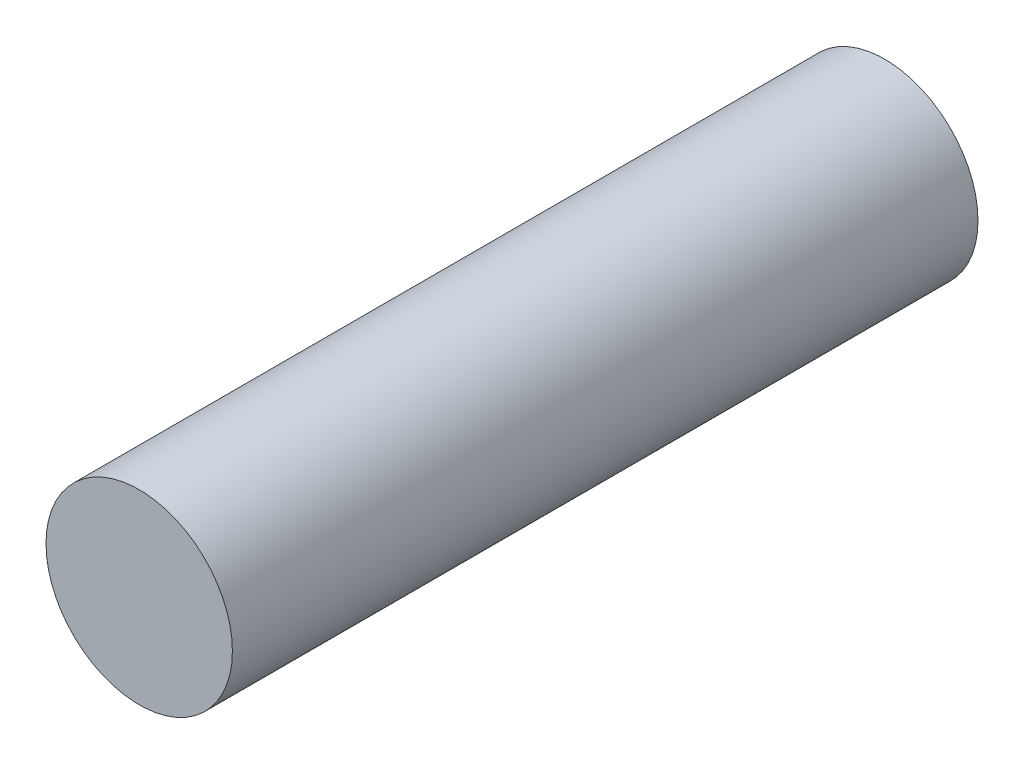
ISO-10303-21;
HEADER;
FILE_DESCRIPTION(('STEP AP214'),'2;1');
FILE_NAME('part.step','',(''),(''),'','','');
FILE_SCHEMA(('AUTOMOTIVE_DESIGN { 1 0 10303 214 1 1 1 1 }'));
ENDSEC;
DATA;
#1=APPLICATION_CONTEXT('core data for automotive mechanical design processes');
#2=APPLICATION_PROTOCOL_DEFINITION('international standard','automotive_design',2000,#1);
#3=PRODUCT_CONTEXT('',#1,'mechanical');
#4=PRODUCT('Part','Part','',(#3));
#5=PRODUCT_RELATED_PRODUCT_CATEGORY('part','',(#4));
#6=PRODUCT_DEFINITION_FORMATION('','',#4);
#7=PRODUCT_DEFINITION_CONTEXT('part definition',#1,'design');
#8=PRODUCT_DEFINITION('design','',#6,#7);
#9=PRODUCT_DEFINITION_SHAPE('','',#8);
#10=(LENGTH_UNIT() NAMED_UNIT(*) SI_UNIT(.MILLI.,.METRE.));
#11=(NAMED_UNIT(*) PLANE_ANGLE_UNIT() SI_UNIT($,.RADIAN.));
#12=(NAMED_UNIT(*) SI_UNIT($,.STERADIAN.) SOLID_ANGLE_UNIT());
#13=UNCERTAINTY_MEASURE_WITH_UNIT(LENGTH_MEASURE(1.E-05),#10,'distance_accuracy_value','');
#14=(GEOMETRIC_REPRESENTATION_CONTEXT(3) GLOBAL_UNCERTAINTY_ASSIGNED_CONTEXT((#13)) GLOBAL_UNIT_ASSIGNED_CONTEXT((#10,
#11,#12)) REPRESENTATION_CONTEXT('',''));
#15=CARTESIAN_POINT('',(0.,0.,0.));
#16=DIRECTION('',(0.,0.,1.));
#17=DIRECTION('',(1.,0.,0.));
#18=AXIS2_PLACEMENT_3D('',#15,#16,#17);
#19=CARTESIAN_POINT('',(0.,0.,10.));
#20=DIRECTION('',(0.,0.,-1.));
#21=DIRECTION('',(-1.,0.,0.));
#22=AXIS2_PLACEMENT_3D('',#19,#20,#21);
#23=CYLINDRICAL_SURFACE('',#22,1.25);
#24=CARTESIAN_POINT('',(0.,0.,10.));
#25=DIRECTION('',(0.,0.,1.));
#26=DIRECTION('',(1.,0.,0.));
#27=AXIS2_PLACEMENT_3D('',#24,#25,#26);
#28=CIRCLE('',#27,1.25);
#29=CARTESIAN_POINT('',(1.25,0.,10.));
#30=VERTEX_POINT('',#29);
#31=EDGE_CURVE('E10',#30,#30,#28,.T.);
#32=ORIENTED_EDGE('',*,*,#31,.F.);
#33=EDGE_LOOP('',(#32));
#34=FACE_BOUND('',#33,.T.);
#35=CARTESIAN_POINT('',(0.,0.,0.));
#36=DIRECTION('',(0.,0.,1.));
#37=DIRECTION('',(1.,0.,0.));
#38=AXIS2_PLACEMENT_3D('',#35,#36,#37);
#39=CIRCLE('',#38,1.25);
#40=CARTESIAN_POINT('',(1.25,0.,0.));
#41=VERTEX_POINT('',#40);
#42=EDGE_CURVE('E46',#41,#41,#39,.T.);
#43=ORIENTED_EDGE('',*,*,#42,.T.);
#44=EDGE_LOOP('',(#43));
#45=FACE_BOUND('',#44,.T.);
#46=ADVANCED_FACE('F43',(#34,#45),#23,.T.);
#47=CARTESIAN_POINT('',(0.,0.,10.));
#48=DIRECTION('',(0.,0.,1.));
#49=DIRECTION('',(1.,0.,0.));
#50=AXIS2_PLACEMENT_3D('',#47,#48,#49);
#51=PLANE('',#50);
#52=ORIENTED_EDGE('',*,*,#31,.T.);
#53=EDGE_LOOP('',(#52));
#54=FACE_BOUND('',#53,.T.);
#55=ADVANCED_FACE('F60',(#54),#51,.T.);
#56=CARTESIAN_POINT('',(0.,0.,0.));
#57=DIRECTION('',(0.,0.,1.));
#58=DIRECTION('',(1.,0.,0.));
#59=AXIS2_PLACEMENT_3D('',#56,#57,#58);
#60=PLANE('',#59);
#61=ORIENTED_EDGE('',*,*,#42,.F.);
#62=EDGE_LOOP('',(#61));
#63=FACE_BOUND('',#62,.T.);
#64=ADVANCED_FACE('F58',(#63),#60,.F.);
#65=CLOSED_SHELL('',(#46,#55,#64));
#66=MANIFOLD_SOLID_BREP('B2',#65);
#67=ADVANCED_BREP_SHAPE_REPRESENTATION('',(#18,#66),#14);
#68=SHAPE_DEFINITION_REPRESENTATION(#9,#67);
ENDSEC;
END-ISO-10303-21;
